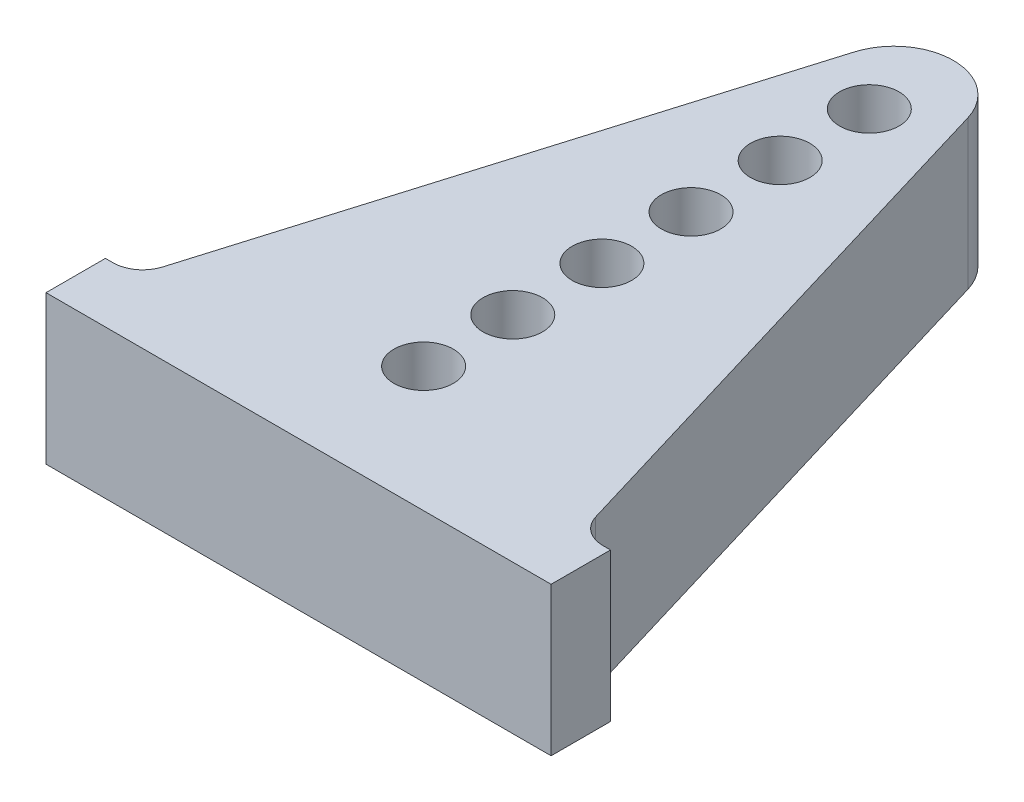
ISO-10303-21;
HEADER;
FILE_DESCRIPTION(('STEP AP214'),'2;1');
FILE_NAME('part.step','',(''),(''),'','','');
FILE_SCHEMA(('AUTOMOTIVE_DESIGN { 1 0 10303 214 1 1 1 1 }'));
ENDSEC;
DATA;
#1=APPLICATION_CONTEXT('core data for automotive mechanical design processes');
#2=APPLICATION_PROTOCOL_DEFINITION('international standard','automotive_design',2000,#1);
#3=PRODUCT_CONTEXT('',#1,'mechanical');
#4=PRODUCT('Part','Part','',(#3));
#5=PRODUCT_RELATED_PRODUCT_CATEGORY('part','',(#4));
#6=PRODUCT_DEFINITION_FORMATION('','',#4);
#7=PRODUCT_DEFINITION_CONTEXT('part definition',#1,'design');
#8=PRODUCT_DEFINITION('design','',#6,#7);
#9=PRODUCT_DEFINITION_SHAPE('','',#8);
#10=(LENGTH_UNIT() NAMED_UNIT(*) SI_UNIT(.MILLI.,.METRE.));
#11=(NAMED_UNIT(*) PLANE_ANGLE_UNIT() SI_UNIT($,.RADIAN.));
#12=(NAMED_UNIT(*) SI_UNIT($,.STERADIAN.) SOLID_ANGLE_UNIT());
#13=UNCERTAINTY_MEASURE_WITH_UNIT(LENGTH_MEASURE(1.E-05),#10,'distance_accuracy_value','');
#14=(GEOMETRIC_REPRESENTATION_CONTEXT(3) GLOBAL_UNCERTAINTY_ASSIGNED_CONTEXT((#13)) GLOBAL_UNIT_ASSIGNED_CONTEXT((#10,
#11,#12)) REPRESENTATION_CONTEXT('',''));
#15=CARTESIAN_POINT('',(0.,0.,0.));
#16=DIRECTION('',(0.,0.,1.));
#17=DIRECTION('',(1.,0.,0.));
#18=AXIS2_PLACEMENT_3D('',#15,#16,#17);
#19=CARTESIAN_POINT('',(0.,2.5,7.51175906169083));
#20=DIRECTION('',(0.,0.,-1.));
#21=DIRECTION('',(-1.,0.,0.));
#22=AXIS2_PLACEMENT_3D('',#19,#20,#21);
#23=PLANE('',#22);
#24=DIRECTION('',(1.,0.,0.));
#25=VECTOR('',#24,1.);
#26=CARTESIAN_POINT('',(0.,-2.5,7.51175906169083));
#27=LINE('',#26,#25);
#28=CARTESIAN_POINT('',(-9.47657930193406,-2.5,7.51175906169083));
#29=VERTEX_POINT('',#28);
#30=CARTESIAN_POINT('',(7.52342069806594,-2.5,7.51175906169083));
#31=VERTEX_POINT('',#30);
#32=EDGE_CURVE('E159',#29,#31,#27,.T.);
#33=ORIENTED_EDGE('',*,*,#32,.T.);
#34=DIRECTION('',(0.,-1.,0.));
#35=VECTOR('',#34,1.);
#36=CARTESIAN_POINT('',(7.52342069806594,2.5,7.51175906169083));
#37=LINE('',#36,#35);
#38=CARTESIAN_POINT('',(7.52342069806594,2.5,7.51175906169083));
#39=VERTEX_POINT('',#38);
#40=EDGE_CURVE('E11',#39,#31,#37,.T.);
#41=ORIENTED_EDGE('',*,*,#40,.F.);
#42=DIRECTION('',(1.,0.,0.));
#43=VECTOR('',#42,1.);
#44=CARTESIAN_POINT('',(0.,2.5,7.51175906169083));
#45=LINE('',#44,#43);
#46=CARTESIAN_POINT('',(-9.47657930193406,2.5,7.51175906169083));
#47=VERTEX_POINT('',#46);
#48=EDGE_CURVE('E93',#47,#39,#45,.T.);
#49=ORIENTED_EDGE('',*,*,#48,.F.);
#50=DIRECTION('',(0.,-1.,0.));
#51=VECTOR('',#50,1.);
#52=CARTESIAN_POINT('',(-9.47657930193406,2.5,7.51175906169083));
#53=LINE('',#52,#51);
#54=EDGE_CURVE('E158',#47,#29,#53,.T.);
#55=ORIENTED_EDGE('',*,*,#54,.T.);
#56=EDGE_LOOP('',(#33,#41,#49,#55));
#57=FACE_BOUND('',#56,.T.);
#58=ADVANCED_FACE('F35',(#57),#23,.F.);
#59=CARTESIAN_POINT('',(7.52342069806594,2.5,0.));
#60=DIRECTION('',(1.,0.,0.));
#61=DIRECTION('',(0.,0.,-1.));
#62=AXIS2_PLACEMENT_3D('',#59,#60,#61);
#63=PLANE('',#62);
#64=DIRECTION('',(0.,0.,1.));
#65=VECTOR('',#64,1.);
#66=CARTESIAN_POINT('',(7.52342069806594,-2.5,0.));
#67=LINE('',#66,#65);
#68=CARTESIAN_POINT('',(7.52342069806594,-2.5,5.51175906169083));
#69=VERTEX_POINT('',#68);
#70=EDGE_CURVE('E162',#69,#31,#67,.T.);
#71=ORIENTED_EDGE('',*,*,#70,.F.);
#72=DIRECTION('',(0.,-1.,0.));
#73=VECTOR('',#72,1.);
#74=CARTESIAN_POINT('',(7.52342069806594,2.5,5.51175906169083));
#75=LINE('',#74,#73);
#76=CARTESIAN_POINT('',(7.52342069806594,2.5,5.51175906169083));
#77=VERTEX_POINT('',#76);
#78=EDGE_CURVE('E43',#77,#69,#75,.T.);
#79=ORIENTED_EDGE('',*,*,#78,.F.);
#80=DIRECTION('',(0.,0.,1.));
#81=VECTOR('',#80,1.);
#82=CARTESIAN_POINT('',(7.52342069806594,2.5,0.));
#83=LINE('',#82,#81);
#84=EDGE_CURVE('E238',#77,#39,#83,.T.);
#85=ORIENTED_EDGE('',*,*,#84,.T.);
#86=ORIENTED_EDGE('',*,*,#40,.T.);
#87=EDGE_LOOP('',(#71,#79,#85,#86));
#88=FACE_BOUND('',#87,.T.);
#89=ADVANCED_FACE('F221',(#88),#63,.T.);
#90=CARTESIAN_POINT('',(0.,2.5,5.51175906169085));
#91=DIRECTION('',(0.,0.,-1.));
#92=DIRECTION('',(-1.,0.,0.));
#93=AXIS2_PLACEMENT_3D('',#90,#91,#92);
#94=PLANE('',#93);
#95=DIRECTION('',(1.,0.,0.));
#96=VECTOR('',#95,1.);
#97=CARTESIAN_POINT('',(0.,-2.5,5.51175906169085));
#98=LINE('',#97,#96);
#99=CARTESIAN_POINT('',(7.26745134895699,-2.5,5.51175906169083));
#100=VERTEX_POINT('',#99);
#101=EDGE_CURVE('E165',#100,#69,#98,.T.);
#102=ORIENTED_EDGE('',*,*,#101,.F.);
#103=DIRECTION('',(0.,-1.,0.));
#104=VECTOR('',#103,1.);
#105=CARTESIAN_POINT('',(7.26745134895699,2.5,5.51175906169083));
#106=LINE('',#105,#104);
#107=CARTESIAN_POINT('',(7.26745134895699,2.5,5.51175906169083));
#108=VERTEX_POINT('',#107);
#109=EDGE_CURVE('E211',#108,#100,#106,.T.);
#110=ORIENTED_EDGE('',*,*,#109,.F.);
#111=DIRECTION('',(1.,0.,0.));
#112=VECTOR('',#111,1.);
#113=CARTESIAN_POINT('',(0.,2.5,5.51175906169085));
#114=LINE('',#113,#112);
#115=EDGE_CURVE('E218',#108,#77,#114,.T.);
#116=ORIENTED_EDGE('',*,*,#115,.T.);
#117=ORIENTED_EDGE('',*,*,#78,.T.);
#118=EDGE_LOOP('',(#102,#110,#116,#117));
#119=FACE_BOUND('',#118,.T.);
#120=ADVANCED_FACE('F216',(#119),#94,.T.);
#121=CARTESIAN_POINT('',(7.26745134895699,2.5,4.51175906169083));
#122=DIRECTION('',(0.,-1.,0.));
#123=DIRECTION('',(0.,0.,-1.));
#124=AXIS2_PLACEMENT_3D('',#121,#122,#123);
#125=CYLINDRICAL_SURFACE('',#124,1.);
#126=CARTESIAN_POINT('',(7.26745134895699,-2.5,4.51175906169083));
#127=DIRECTION('',(0.,1.,0.));
#128=DIRECTION('',(0.,0.,1.));
#129=AXIS2_PLACEMENT_3D('',#126,#127,#128);
#130=CIRCLE('',#129,1.);
#131=CARTESIAN_POINT('',(6.30962506373584,-2.5,4.79910694725717));
#132=VERTEX_POINT('',#131);
#133=EDGE_CURVE('E168',#100,#132,#130,.F.);
#134=ORIENTED_EDGE('',*,*,#133,.T.);
#135=DIRECTION('',(0.,-1.,0.));
#136=VECTOR('',#135,1.);
#137=CARTESIAN_POINT('',(6.30962506373584,2.5,4.79910694725717));
#138=LINE('',#137,#136);
#139=CARTESIAN_POINT('',(6.30962506373584,2.5,4.79910694725717));
#140=VERTEX_POINT('',#139);
#141=EDGE_CURVE('E209',#140,#132,#138,.T.);
#142=ORIENTED_EDGE('',*,*,#141,.F.);
#143=CARTESIAN_POINT('',(7.26745134895699,2.5,4.51175906169083));
#144=DIRECTION('',(0.,1.,0.));
#145=DIRECTION('',(0.,0.,1.));
#146=AXIS2_PLACEMENT_3D('',#143,#144,#145);
#147=CIRCLE('',#146,1.);
#148=EDGE_CURVE('E234',#108,#140,#147,.F.);
#149=ORIENTED_EDGE('',*,*,#148,.F.);
#150=ORIENTED_EDGE('',*,*,#109,.T.);
#151=EDGE_LOOP('',(#134,#142,#149,#150));
#152=FACE_BOUND('',#151,.T.);
#153=ADVANCED_FACE('F231',(#152),#125,.F.);
#154=CARTESIAN_POINT('',(4.46779172436577,2.5,-1.34033751730973));
#155=DIRECTION('',(0.957826285221151,0.,-0.287347885566345));
#156=DIRECTION('',(-0.287347885566345,0.,-0.957826285221151));
#157=AXIS2_PLACEMENT_3D('',#154,#155,#156);
#158=PLANE('',#157);
#159=DIRECTION('',(0.287347885566345,0.,0.957826285221151));
#160=VECTOR('',#159,1.);
#161=CARTESIAN_POINT('',(4.46779172436577,-2.5,-1.34033751730973));
#162=LINE('',#161,#160);
#163=CARTESIAN_POINT('',(0.939073268508239,-2.5,-13.1027323701682));
#164=VERTEX_POINT('',#163);
#165=EDGE_CURVE('E171',#164,#132,#162,.T.);
#166=ORIENTED_EDGE('',*,*,#165,.F.);
#167=DIRECTION('',(0.,-1.,0.));
#168=VECTOR('',#167,1.);
#169=CARTESIAN_POINT('',(0.939073268508239,2.5,-13.1027323701682));
#170=LINE('',#169,#168);
#171=CARTESIAN_POINT('',(0.939073268508239,2.5,-13.1027323701682));
#172=VERTEX_POINT('',#171);
#173=EDGE_CURVE('E207',#172,#164,#170,.T.);
#174=ORIENTED_EDGE('',*,*,#173,.F.);
#175=DIRECTION('',(0.287347885566345,0.,0.957826285221151));
#176=VECTOR('',#175,1.);
#177=CARTESIAN_POINT('',(4.46779172436577,2.5,-1.34033751730973));
#178=LINE('',#177,#176);
#179=EDGE_CURVE('E236',#172,#140,#178,.T.);
#180=ORIENTED_EDGE('',*,*,#179,.T.);
#181=ORIENTED_EDGE('',*,*,#141,.T.);
#182=EDGE_LOOP('',(#166,#174,#180,#181));
#183=FACE_BOUND('',#182,.T.);
#184=ADVANCED_FACE('F276',(#183),#158,.T.);
#185=CARTESIAN_POINT('',(-0.976579301934065,2.5,-12.5280365990355));
#186=DIRECTION('',(0.,-1.,0.));
#187=DIRECTION('',(0.,0.,-1.));
#188=AXIS2_PLACEMENT_3D('',#185,#186,#187);
#189=CYLINDRICAL_SURFACE('',#188,2.);
#190=CARTESIAN_POINT('',(-0.976579301934065,-2.5,-12.5280365990355));
#191=DIRECTION('',(0.,1.,0.));
#192=DIRECTION('',(0.,0.,1.));
#193=AXIS2_PLACEMENT_3D('',#190,#191,#192);
#194=CIRCLE('',#193,2.);
#195=CARTESIAN_POINT('',(-2.89223187237637,-2.5,-13.1027323701682));
#196=VERTEX_POINT('',#195);
#197=EDGE_CURVE('E174',#164,#196,#194,.T.);
#198=ORIENTED_EDGE('',*,*,#197,.T.);
#199=DIRECTION('',(0.,-1.,0.));
#200=VECTOR('',#199,1.);
#201=CARTESIAN_POINT('',(-2.89223187237637,2.5,-13.1027323701682));
#202=LINE('',#201,#200);
#203=CARTESIAN_POINT('',(-2.89223187237637,2.5,-13.1027323701682));
#204=VERTEX_POINT('',#203);
#205=EDGE_CURVE('E205',#204,#196,#202,.T.);
#206=ORIENTED_EDGE('',*,*,#205,.F.);
#207=CARTESIAN_POINT('',(-0.976579301934065,2.5,-12.5280365990355));
#208=DIRECTION('',(0.,1.,0.));
#209=DIRECTION('',(0.,0.,1.));
#210=AXIS2_PLACEMENT_3D('',#207,#208,#209);
#211=CIRCLE('',#210,2.);
#212=EDGE_CURVE('E244',#172,#204,#211,.T.);
#213=ORIENTED_EDGE('',*,*,#212,.F.);
#214=ORIENTED_EDGE('',*,*,#173,.T.);
#215=EDGE_LOOP('',(#198,#206,#213,#214));
#216=FACE_BOUND('',#215,.T.);
#217=ADVANCED_FACE('F279',(#216),#189,.T.);
#218=CARTESIAN_POINT('',(-6.25968035176772,2.5,-1.87790410553031));
#219=DIRECTION('',(-0.957826285221151,0.,-0.287347885566345));
#220=DIRECTION('',(-0.287347885566345,0.,0.957826285221152));
#221=AXIS2_PLACEMENT_3D('',#218,#219,#220);
#222=PLANE('',#221);
#223=DIRECTION('',(0.287347885566345,0.,-0.957826285221152));
#224=VECTOR('',#223,1.);
#225=CARTESIAN_POINT('',(-6.25968035176772,-2.5,-1.87790410553031));
#226=LINE('',#225,#224);
#227=CARTESIAN_POINT('',(-8.26278366760396,-2.5,4.79910694725717));
#228=VERTEX_POINT('',#227);
#229=EDGE_CURVE('E177',#228,#196,#226,.T.);
#230=ORIENTED_EDGE('',*,*,#229,.F.);
#231=DIRECTION('',(0.,-1.,0.));
#232=VECTOR('',#231,1.);
#233=CARTESIAN_POINT('',(-8.26278366760396,2.5,4.79910694725717));
#234=LINE('',#233,#232);
#235=CARTESIAN_POINT('',(-8.26278366760396,2.5,4.79910694725717));
#236=VERTEX_POINT('',#235);
#237=EDGE_CURVE('E126',#236,#228,#234,.T.);
#238=ORIENTED_EDGE('',*,*,#237,.F.);
#239=DIRECTION('',(0.287347885566345,0.,-0.957826285221152));
#240=VECTOR('',#239,1.);
#241=CARTESIAN_POINT('',(-6.25968035176772,2.5,-1.87790410553031));
#242=LINE('',#241,#240);
#243=EDGE_CURVE('E133',#236,#204,#242,.T.);
#244=ORIENTED_EDGE('',*,*,#243,.T.);
#245=ORIENTED_EDGE('',*,*,#205,.T.);
#246=EDGE_LOOP('',(#230,#238,#244,#245));
#247=FACE_BOUND('',#246,.T.);
#248=ADVANCED_FACE('F247',(#247),#222,.T.);
#249=CARTESIAN_POINT('',(-9.22060995282512,2.5,4.51175906169083));
#250=DIRECTION('',(0.,-1.,0.));
#251=DIRECTION('',(0.,0.,-1.));
#252=AXIS2_PLACEMENT_3D('',#249,#250,#251);
#253=CYLINDRICAL_SURFACE('',#252,1.);
#254=CARTESIAN_POINT('',(-9.22060995282512,-2.5,4.51175906169083));
#255=DIRECTION('',(0.,1.,0.));
#256=DIRECTION('',(0.,0.,1.));
#257=AXIS2_PLACEMENT_3D('',#254,#255,#256);
#258=CIRCLE('',#257,1.);
#259=CARTESIAN_POINT('',(-9.22060995282512,-2.5,5.51175906169083));
#260=VERTEX_POINT('',#259);
#261=EDGE_CURVE('E121',#260,#228,#258,.T.);
#262=ORIENTED_EDGE('',*,*,#261,.F.);
#263=DIRECTION('',(0.,-1.,0.));
#264=VECTOR('',#263,1.);
#265=CARTESIAN_POINT('',(-9.22060995282512,2.5,5.51175906169083));
#266=LINE('',#265,#264);
#267=CARTESIAN_POINT('',(-9.22060995282512,2.5,5.51175906169083));
#268=VERTEX_POINT('',#267);
#269=EDGE_CURVE('E116',#268,#260,#266,.T.);
#270=ORIENTED_EDGE('',*,*,#269,.F.);
#271=CARTESIAN_POINT('',(-9.22060995282512,2.5,4.51175906169083));
#272=DIRECTION('',(0.,1.,0.));
#273=DIRECTION('',(0.,0.,1.));
#274=AXIS2_PLACEMENT_3D('',#271,#272,#273);
#275=CIRCLE('',#274,1.);
#276=EDGE_CURVE('E119',#268,#236,#275,.T.);
#277=ORIENTED_EDGE('',*,*,#276,.T.);
#278=ORIENTED_EDGE('',*,*,#237,.T.);
#279=EDGE_LOOP('',(#262,#270,#277,#278));
#280=FACE_BOUND('',#279,.T.);
#281=ADVANCED_FACE('F118',(#280),#253,.F.);
#282=CARTESIAN_POINT('',(0.,2.5,5.51175906169083));
#283=DIRECTION('',(0.,0.,-1.));
#284=DIRECTION('',(-1.,0.,0.));
#285=AXIS2_PLACEMENT_3D('',#282,#283,#284);
#286=PLANE('',#285);
#287=DIRECTION('',(1.,0.,0.));
#288=VECTOR('',#287,1.);
#289=CARTESIAN_POINT('',(0.,-2.5,5.51175906169083));
#290=LINE('',#289,#288);
#291=CARTESIAN_POINT('',(-9.47657930193406,-2.5,5.51175906169083));
#292=VERTEX_POINT('',#291);
#293=EDGE_CURVE('E181',#292,#260,#290,.T.);
#294=ORIENTED_EDGE('',*,*,#293,.F.);
#295=DIRECTION('',(0.,-1.,0.));
#296=VECTOR('',#295,1.);
#297=CARTESIAN_POINT('',(-9.47657930193406,2.5,5.51175906169083));
#298=LINE('',#297,#296);
#299=CARTESIAN_POINT('',(-9.47657930193406,2.5,5.51175906169083));
#300=VERTEX_POINT('',#299);
#301=EDGE_CURVE('E84',#300,#292,#298,.T.);
#302=ORIENTED_EDGE('',*,*,#301,.F.);
#303=DIRECTION('',(1.,0.,0.));
#304=VECTOR('',#303,1.);
#305=CARTESIAN_POINT('',(0.,2.5,5.51175906169083));
#306=LINE('',#305,#304);
#307=EDGE_CURVE('E131',#300,#268,#306,.T.);
#308=ORIENTED_EDGE('',*,*,#307,.T.);
#309=ORIENTED_EDGE('',*,*,#269,.T.);
#310=EDGE_LOOP('',(#294,#302,#308,#309));
#311=FACE_BOUND('',#310,.T.);
#312=ADVANCED_FACE('F135',(#311),#286,.T.);
#313=CARTESIAN_POINT('',(-0.976579301934063,2.5,-5.69826956892781));
#314=DIRECTION('',(0.,-1.,0.));
#315=DIRECTION('',(0.,0.,-1.));
#316=AXIS2_PLACEMENT_3D('',#313,#314,#315);
#317=CYLINDRICAL_SURFACE('',#316,1.);
#318=CARTESIAN_POINT('',(-0.976579301934063,2.5,-5.69826956892781));
#319=DIRECTION('',(0.,1.,0.));
#320=DIRECTION('',(0.,0.,1.));
#321=AXIS2_PLACEMENT_3D('',#318,#319,#320);
#322=CIRCLE('',#321,1.);
#323=CARTESIAN_POINT('',(-0.976579301934063,2.5,-4.69826956892781));
#324=VERTEX_POINT('',#323);
#325=EDGE_CURVE('E152',#324,#324,#322,.T.);
#326=ORIENTED_EDGE('',*,*,#325,.T.);
#327=EDGE_LOOP('',(#326));
#328=FACE_BOUND('',#327,.T.);
#329=CARTESIAN_POINT('',(-0.976579301934063,-2.5,-5.69826956892781));
#330=DIRECTION('',(0.,1.,0.));
#331=DIRECTION('',(0.,0.,1.));
#332=AXIS2_PLACEMENT_3D('',#329,#330,#331);
#333=CIRCLE('',#332,1.);
#334=CARTESIAN_POINT('',(-0.976579301934063,-2.5,-4.69826956892781));
#335=VERTEX_POINT('',#334);
#336=EDGE_CURVE('E196',#335,#335,#333,.T.);
#337=ORIENTED_EDGE('',*,*,#336,.F.);
#338=EDGE_LOOP('',(#337));
#339=FACE_BOUND('',#338,.T.);
#340=ADVANCED_FACE('F288',(#328,#339),#317,.F.);
#341=CARTESIAN_POINT('',(-0.976579301934031,2.5,-2.69826956892782));
#342=DIRECTION('',(0.,-1.,0.));
#343=DIRECTION('',(0.,0.,-1.));
#344=AXIS2_PLACEMENT_3D('',#341,#342,#343);
#345=CYLINDRICAL_SURFACE('',#344,1.);
#346=CARTESIAN_POINT('',(-0.976579301934031,2.5,-2.69826956892782));
#347=DIRECTION('',(0.,1.,0.));
#348=DIRECTION('',(0.,0.,1.));
#349=AXIS2_PLACEMENT_3D('',#346,#347,#348);
#350=CIRCLE('',#349,1.);
#351=CARTESIAN_POINT('',(-0.976579301934031,2.5,-1.69826956892782));
#352=VERTEX_POINT('',#351);
#353=EDGE_CURVE('E149',#352,#352,#350,.T.);
#354=ORIENTED_EDGE('',*,*,#353,.T.);
#355=EDGE_LOOP('',(#354));
#356=FACE_BOUND('',#355,.T.);
#357=CARTESIAN_POINT('',(-0.976579301934031,-2.5,-2.69826956892782));
#358=DIRECTION('',(0.,1.,0.));
#359=DIRECTION('',(0.,0.,1.));
#360=AXIS2_PLACEMENT_3D('',#357,#358,#359);
#361=CIRCLE('',#360,1.);
#362=CARTESIAN_POINT('',(-0.976579301934031,-2.5,-1.69826956892782));
#363=VERTEX_POINT('',#362);
#364=EDGE_CURVE('E193',#363,#363,#361,.T.);
#365=ORIENTED_EDGE('',*,*,#364,.F.);
#366=EDGE_LOOP('',(#365));
#367=FACE_BOUND('',#366,.T.);
#368=ADVANCED_FACE('F292',(#356,#367),#345,.F.);
#369=CARTESIAN_POINT('',(-0.976579301934,2.5,0.301730431072185));
#370=DIRECTION('',(0.,-1.,0.));
#371=DIRECTION('',(0.,0.,-1.));
#372=AXIS2_PLACEMENT_3D('',#369,#370,#371);
#373=CYLINDRICAL_SURFACE('',#372,1.);
#374=CARTESIAN_POINT('',(-0.976579301934,2.5,0.301730431072185));
#375=DIRECTION('',(0.,1.,0.));
#376=DIRECTION('',(0.,0.,1.));
#377=AXIS2_PLACEMENT_3D('',#374,#375,#376);
#378=CIRCLE('',#377,1.);
#379=CARTESIAN_POINT('',(-0.976579301934,2.5,1.30173043107219));
#380=VERTEX_POINT('',#379);
#381=EDGE_CURVE('E146',#380,#380,#378,.T.);
#382=ORIENTED_EDGE('',*,*,#381,.T.);
#383=EDGE_LOOP('',(#382));
#384=FACE_BOUND('',#383,.T.);
#385=CARTESIAN_POINT('',(-0.976579301934,-2.5,0.301730431072185));
#386=DIRECTION('',(0.,1.,0.));
#387=DIRECTION('',(0.,0.,1.));
#388=AXIS2_PLACEMENT_3D('',#385,#386,#387);
#389=CIRCLE('',#388,1.);
#390=CARTESIAN_POINT('',(-0.976579301934,-2.5,1.30173043107219));
#391=VERTEX_POINT('',#390);
#392=EDGE_CURVE('E190',#391,#391,#389,.T.);
#393=ORIENTED_EDGE('',*,*,#392,.F.);
#394=EDGE_LOOP('',(#393));
#395=FACE_BOUND('',#394,.T.);
#396=ADVANCED_FACE('F298',(#384,#395),#373,.F.);
#397=CARTESIAN_POINT('',(-0.976579301933968,2.5,3.30173043107218));
#398=DIRECTION('',(0.,-1.,0.));
#399=DIRECTION('',(0.,0.,-1.));
#400=AXIS2_PLACEMENT_3D('',#397,#398,#399);
#401=CYLINDRICAL_SURFACE('',#400,1.);
#402=CARTESIAN_POINT('',(-0.976579301933968,2.5,3.30173043107218));
#403=DIRECTION('',(0.,1.,0.));
#404=DIRECTION('',(0.,0.,1.));
#405=AXIS2_PLACEMENT_3D('',#402,#403,#404);
#406=CIRCLE('',#405,1.);
#407=CARTESIAN_POINT('',(-0.976579301933968,2.5,4.30173043107218));
#408=VERTEX_POINT('',#407);
#409=EDGE_CURVE('E143',#408,#408,#406,.T.);
#410=ORIENTED_EDGE('',*,*,#409,.T.);
#411=EDGE_LOOP('',(#410));
#412=FACE_BOUND('',#411,.T.);
#413=CARTESIAN_POINT('',(-0.976579301933968,-2.5,3.30173043107218));
#414=DIRECTION('',(0.,1.,0.));
#415=DIRECTION('',(0.,0.,1.));
#416=AXIS2_PLACEMENT_3D('',#413,#414,#415);
#417=CIRCLE('',#416,1.);
#418=CARTESIAN_POINT('',(-0.976579301933968,-2.5,4.30173043107218));
#419=VERTEX_POINT('',#418);
#420=EDGE_CURVE('E187',#419,#419,#417,.T.);
#421=ORIENTED_EDGE('',*,*,#420,.F.);
#422=EDGE_LOOP('',(#421));
#423=FACE_BOUND('',#422,.T.);
#424=ADVANCED_FACE('F261',(#412,#423),#401,.F.);
#425=CARTESIAN_POINT('',(-0.976579301934104,2.5,-11.6982695689278));
#426=DIRECTION('',(0.,-1.,0.));
#427=DIRECTION('',(0.,0.,-1.));
#428=AXIS2_PLACEMENT_3D('',#425,#426,#427);
#429=CYLINDRICAL_SURFACE('',#428,1.);
#430=CARTESIAN_POINT('',(-0.976579301934104,2.5,-11.6982695689278));
#431=DIRECTION('',(0.,1.,0.));
#432=DIRECTION('',(0.,0.,1.));
#433=AXIS2_PLACEMENT_3D('',#430,#431,#432);
#434=CIRCLE('',#433,1.);
#435=CARTESIAN_POINT('',(-0.976579301934104,2.5,-10.6982695689278));
#436=VERTEX_POINT('',#435);
#437=EDGE_CURVE('E137',#436,#436,#434,.T.);
#438=ORIENTED_EDGE('',*,*,#437,.T.);
#439=EDGE_LOOP('',(#438));
#440=FACE_BOUND('',#439,.T.);
#441=CARTESIAN_POINT('',(-0.976579301934104,-2.5,-11.6982695689278));
#442=DIRECTION('',(0.,1.,0.));
#443=DIRECTION('',(0.,0.,1.));
#444=AXIS2_PLACEMENT_3D('',#441,#442,#443);
#445=CIRCLE('',#444,1.);
#446=CARTESIAN_POINT('',(-0.976579301934104,-2.5,-10.6982695689278));
#447=VERTEX_POINT('',#446);
#448=EDGE_CURVE('E184',#447,#447,#445,.T.);
#449=ORIENTED_EDGE('',*,*,#448,.F.);
#450=EDGE_LOOP('',(#449));
#451=FACE_BOUND('',#450,.T.);
#452=ADVANCED_FACE('F253',(#440,#451),#429,.F.);
#453=CARTESIAN_POINT('',(-9.47657930193406,2.5,0.));
#454=DIRECTION('',(1.,0.,0.));
#455=DIRECTION('',(0.,0.,-1.));
#456=AXIS2_PLACEMENT_3D('',#453,#454,#455);
#457=PLANE('',#456);
#458=DIRECTION('',(0.,0.,1.));
#459=VECTOR('',#458,1.);
#460=CARTESIAN_POINT('',(-9.47657930193406,-2.5,0.));
#461=LINE('',#460,#459);
#462=EDGE_CURVE('E87',#292,#29,#461,.T.);
#463=ORIENTED_EDGE('',*,*,#462,.T.);
#464=ORIENTED_EDGE('',*,*,#54,.F.);
#465=DIRECTION('',(0.,0.,1.));
#466=VECTOR('',#465,1.);
#467=CARTESIAN_POINT('',(-9.47657930193406,2.5,0.));
#468=LINE('',#467,#466);
#469=EDGE_CURVE('E51',#300,#47,#468,.T.);
#470=ORIENTED_EDGE('',*,*,#469,.F.);
#471=ORIENTED_EDGE('',*,*,#301,.T.);
#472=EDGE_LOOP('',(#463,#464,#470,#471));
#473=FACE_BOUND('',#472,.T.);
#474=ADVANCED_FACE('F250',(#473),#457,.F.);
#475=CARTESIAN_POINT('',(-0.976579301934094,2.5,-8.69826956892782));
#476=DIRECTION('',(0.,-1.,0.));
#477=DIRECTION('',(0.,0.,-1.));
#478=AXIS2_PLACEMENT_3D('',#475,#476,#477);
#479=CYLINDRICAL_SURFACE('',#478,1.);
#480=CARTESIAN_POINT('',(-0.976579301934094,2.5,-8.69826956892782));
#481=DIRECTION('',(0.,1.,0.));
#482=DIRECTION('',(0.,0.,1.));
#483=AXIS2_PLACEMENT_3D('',#480,#481,#482);
#484=CIRCLE('',#483,1.);
#485=CARTESIAN_POINT('',(-0.976579301934094,2.5,-7.69826956892781));
#486=VERTEX_POINT('',#485);
#487=EDGE_CURVE('E155',#486,#486,#484,.T.);
#488=ORIENTED_EDGE('',*,*,#487,.T.);
#489=EDGE_LOOP('',(#488));
#490=FACE_BOUND('',#489,.T.);
#491=CARTESIAN_POINT('',(-0.976579301934094,-2.5,-8.69826956892782));
#492=DIRECTION('',(0.,1.,0.));
#493=DIRECTION('',(0.,0.,1.));
#494=AXIS2_PLACEMENT_3D('',#491,#492,#493);
#495=CIRCLE('',#494,1.);
#496=CARTESIAN_POINT('',(-0.976579301934094,-2.5,-7.69826956892781));
#497=VERTEX_POINT('',#496);
#498=EDGE_CURVE('E199',#497,#497,#495,.T.);
#499=ORIENTED_EDGE('',*,*,#498,.F.);
#500=EDGE_LOOP('',(#499));
#501=FACE_BOUND('',#500,.T.);
#502=ADVANCED_FACE('F252',(#490,#501),#479,.F.);
#503=CARTESIAN_POINT('',(0.,2.5,0.));
#504=DIRECTION('',(0.,1.,0.));
#505=DIRECTION('',(0.,0.,1.));
#506=AXIS2_PLACEMENT_3D('',#503,#504,#505);
#507=PLANE('',#506);
#508=ORIENTED_EDGE('',*,*,#48,.T.);
#509=ORIENTED_EDGE('',*,*,#84,.F.);
#510=ORIENTED_EDGE('',*,*,#115,.F.);
#511=ORIENTED_EDGE('',*,*,#148,.T.);
#512=ORIENTED_EDGE('',*,*,#179,.F.);
#513=ORIENTED_EDGE('',*,*,#212,.T.);
#514=ORIENTED_EDGE('',*,*,#243,.F.);
#515=ORIENTED_EDGE('',*,*,#276,.F.);
#516=ORIENTED_EDGE('',*,*,#307,.F.);
#517=ORIENTED_EDGE('',*,*,#469,.T.);
#518=EDGE_LOOP('',(#508,#509,#510,#511,#512,#513,#514,#515,#516,#517));
#519=FACE_BOUND('',#518,.T.);
#520=ORIENTED_EDGE('',*,*,#437,.F.);
#521=EDGE_LOOP('',(#520));
#522=FACE_BOUND('',#521,.T.);
#523=ORIENTED_EDGE('',*,*,#409,.F.);
#524=EDGE_LOOP('',(#523));
#525=FACE_BOUND('',#524,.T.);
#526=ORIENTED_EDGE('',*,*,#381,.F.);
#527=EDGE_LOOP('',(#526));
#528=FACE_BOUND('',#527,.T.);
#529=ORIENTED_EDGE('',*,*,#353,.F.);
#530=EDGE_LOOP('',(#529));
#531=FACE_BOUND('',#530,.T.);
#532=ORIENTED_EDGE('',*,*,#325,.F.);
#533=EDGE_LOOP('',(#532));
#534=FACE_BOUND('',#533,.T.);
#535=ORIENTED_EDGE('',*,*,#487,.F.);
#536=EDGE_LOOP('',(#535));
#537=FACE_BOUND('',#536,.T.);
#538=ADVANCED_FACE('F129',(#519,#522,#525,#528,#531,#534,#537),#507,.T.);
#539=CARTESIAN_POINT('',(0.,-2.5,0.));
#540=DIRECTION('',(0.,1.,0.));
#541=DIRECTION('',(0.,0.,1.));
#542=AXIS2_PLACEMENT_3D('',#539,#540,#541);
#543=PLANE('',#542);
#544=ORIENTED_EDGE('',*,*,#32,.F.);
#545=ORIENTED_EDGE('',*,*,#462,.F.);
#546=ORIENTED_EDGE('',*,*,#293,.T.);
#547=ORIENTED_EDGE('',*,*,#261,.T.);
#548=ORIENTED_EDGE('',*,*,#229,.T.);
#549=ORIENTED_EDGE('',*,*,#197,.F.);
#550=ORIENTED_EDGE('',*,*,#165,.T.);
#551=ORIENTED_EDGE('',*,*,#133,.F.);
#552=ORIENTED_EDGE('',*,*,#101,.T.);
#553=ORIENTED_EDGE('',*,*,#70,.T.);
#554=EDGE_LOOP('',(#544,#545,#546,#547,#548,#549,#550,#551,#552,#553));
#555=FACE_BOUND('',#554,.T.);
#556=ORIENTED_EDGE('',*,*,#448,.T.);
#557=EDGE_LOOP('',(#556));
#558=FACE_BOUND('',#557,.T.);
#559=ORIENTED_EDGE('',*,*,#420,.T.);
#560=EDGE_LOOP('',(#559));
#561=FACE_BOUND('',#560,.T.);
#562=ORIENTED_EDGE('',*,*,#392,.T.);
#563=EDGE_LOOP('',(#562));
#564=FACE_BOUND('',#563,.T.);
#565=ORIENTED_EDGE('',*,*,#364,.T.);
#566=EDGE_LOOP('',(#565));
#567=FACE_BOUND('',#566,.T.);
#568=ORIENTED_EDGE('',*,*,#336,.T.);
#569=EDGE_LOOP('',(#568));
#570=FACE_BOUND('',#569,.T.);
#571=ORIENTED_EDGE('',*,*,#498,.T.);
#572=EDGE_LOOP('',(#571));
#573=FACE_BOUND('',#572,.T.);
#574=ADVANCED_FACE('F225',(#555,#558,#561,#564,#567,#570,#573),#543,.F.);
#575=CLOSED_SHELL('',(#58,#89,#120,#153,#184,#217,#248,#281,#312,#340,#368,#396,#424,#452,#474,
#502,#538,#574));
#576=MANIFOLD_SOLID_BREP('B2',#575);
#577=ADVANCED_BREP_SHAPE_REPRESENTATION('',(#18,#576),#14);
#578=SHAPE_DEFINITION_REPRESENTATION(#9,#577);
ENDSEC;
END-ISO-10303-21;
